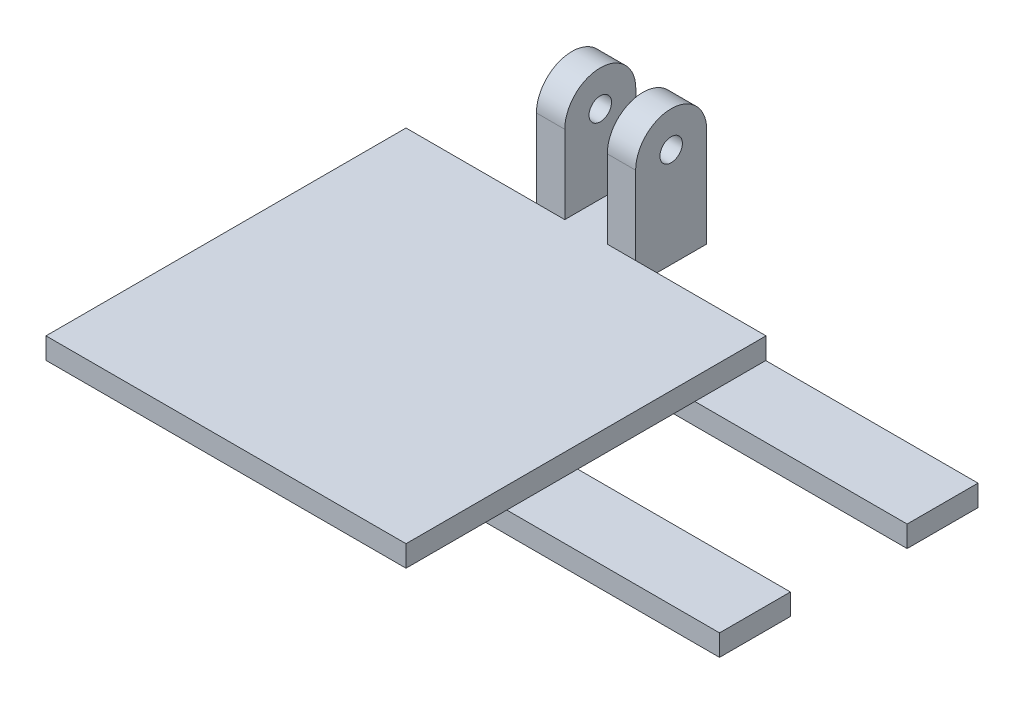
ISO-10303-21;
HEADER;
FILE_DESCRIPTION(('STEP AP214'),'2;1');
FILE_NAME('part.step','',(''),(''),'','','');
FILE_SCHEMA(('AUTOMOTIVE_DESIGN { 1 0 10303 214 1 1 1 1 }'));
ENDSEC;
DATA;
#1=APPLICATION_CONTEXT('core data for automotive mechanical design processes');
#2=APPLICATION_PROTOCOL_DEFINITION('international standard','automotive_design',2000,#1);
#3=PRODUCT_CONTEXT('',#1,'mechanical');
#4=PRODUCT('Part','Part','',(#3));
#5=PRODUCT_RELATED_PRODUCT_CATEGORY('part','',(#4));
#6=PRODUCT_DEFINITION_FORMATION('','',#4);
#7=PRODUCT_DEFINITION_CONTEXT('part definition',#1,'design');
#8=PRODUCT_DEFINITION('design','',#6,#7);
#9=PRODUCT_DEFINITION_SHAPE('','',#8);
#10=(LENGTH_UNIT() NAMED_UNIT(*) SI_UNIT(.MILLI.,.METRE.));
#11=(NAMED_UNIT(*) PLANE_ANGLE_UNIT() SI_UNIT($,.RADIAN.));
#12=(NAMED_UNIT(*) SI_UNIT($,.STERADIAN.) SOLID_ANGLE_UNIT());
#13=UNCERTAINTY_MEASURE_WITH_UNIT(LENGTH_MEASURE(1.E-05),#10,'distance_accuracy_value','');
#14=(GEOMETRIC_REPRESENTATION_CONTEXT(3) GLOBAL_UNCERTAINTY_ASSIGNED_CONTEXT((#13)) GLOBAL_UNIT_ASSIGNED_CONTEXT((#10,
#11,#12)) REPRESENTATION_CONTEXT('',''));
#15=CARTESIAN_POINT('',(0.,0.,0.));
#16=DIRECTION('',(0.,0.,1.));
#17=DIRECTION('',(1.,0.,0.));
#18=AXIS2_PLACEMENT_3D('',#15,#16,#17);
#19=CARTESIAN_POINT('',(0.,0.,0.));
#20=DIRECTION('',(0.,1.,0.));
#21=DIRECTION('',(0.,0.,1.));
#22=AXIS2_PLACEMENT_3D('',#19,#20,#21);
#23=PLANE('',#22);
#24=DIRECTION('',(-1.,0.,0.));
#25=VECTOR('',#24,1.);
#26=CARTESIAN_POINT('',(80.7529136783685,0.,-40.7574395962865));
#27=LINE('',#26,#25);
#28=CARTESIAN_POINT('',(50.8,0.,-40.7574395962864));
#29=VERTEX_POINT('',#28);
#30=CARTESIAN_POINT('',(0.,0.,-40.7574395962864));
#31=VERTEX_POINT('',#30);
#32=EDGE_CURVE('E65',#29,#31,#27,.T.);
#33=ORIENTED_EDGE('',*,*,#32,.F.);
#34=DIRECTION('',(0.,0.,-1.));
#35=VECTOR('',#34,1.);
#36=CARTESIAN_POINT('',(50.8,0.,0.));
#37=LINE('',#36,#35);
#38=CARTESIAN_POINT('',(50.8,0.,-24.2227773158367));
#39=VERTEX_POINT('',#38);
#40=EDGE_CURVE('E431',#39,#29,#37,.T.);
#41=ORIENTED_EDGE('',*,*,#40,.F.);
#42=DIRECTION('',(1.,0.,0.));
#43=VECTOR('',#42,1.);
#44=CARTESIAN_POINT('',(0.0172401323816768,0.,-24.2227773158367));
#45=LINE('',#44,#43);
#46=CARTESIAN_POINT('',(0.0172401323816768,0.,-24.2227773158367));
#47=VERTEX_POINT('',#46);
#48=EDGE_CURVE('E253',#47,#39,#45,.T.);
#49=ORIENTED_EDGE('',*,*,#48,.F.);
#50=DIRECTION('',(0.,0.,-1.));
#51=VECTOR('',#50,1.);
#52=CARTESIAN_POINT('',(0.0172401323816768,0.,-14.2227773158367));
#53=LINE('',#52,#51);
#54=CARTESIAN_POINT('',(0.0172401323816768,0.,-14.2227773158367));
#55=VERTEX_POINT('',#54);
#56=EDGE_CURVE('E249',#55,#47,#53,.T.);
#57=ORIENTED_EDGE('',*,*,#56,.F.);
#58=DIRECTION('',(-1.,0.,0.));
#59=VECTOR('',#58,1.);
#60=CARTESIAN_POINT('',(30.0172401323817,0.,-14.2227773158367));
#61=LINE('',#60,#59);
#62=CARTESIAN_POINT('',(50.8,0.,-14.2227773158367));
#63=VERTEX_POINT('',#62);
#64=EDGE_CURVE('E11',#63,#55,#61,.T.);
#65=ORIENTED_EDGE('',*,*,#64,.F.);
#66=CARTESIAN_POINT('',(50.8,0.,0.));
#67=VERTEX_POINT('',#66);
#68=EDGE_CURVE('E348',#67,#63,#37,.T.);
#69=ORIENTED_EDGE('',*,*,#68,.F.);
#70=DIRECTION('',(1.,0.,0.));
#71=VECTOR('',#70,1.);
#72=CARTESIAN_POINT('',(0.,0.,0.));
#73=LINE('',#72,#71);
#74=CARTESIAN_POINT('',(0.,0.,0.));
#75=VERTEX_POINT('',#74);
#76=EDGE_CURVE('E320',#75,#67,#73,.T.);
#77=ORIENTED_EDGE('',*,*,#76,.F.);
#78=DIRECTION('',(0.,0.,-1.));
#79=VECTOR('',#78,1.);
#80=CARTESIAN_POINT('',(0.,0.,0.));
#81=LINE('',#80,#79);
#82=EDGE_CURVE('E325',#75,#31,#81,.T.);
#83=ORIENTED_EDGE('',*,*,#82,.T.);
#84=EDGE_LOOP('',(#33,#41,#49,#57,#65,#69,#77,#83));
#85=FACE_BOUND('',#84,.T.);
#86=ADVANCED_FACE('F39',(#85),#23,.F.);
#87=DIRECTION('',(1.,0.,0.));
#88=VECTOR('',#87,1.);
#89=CARTESIAN_POINT('',(80.7529136783685,0.,-50.7574395962865));
#90=LINE('',#89,#88);
#91=CARTESIAN_POINT('',(0.,0.,-50.7574395962864));
#92=VERTEX_POINT('',#91);
#93=CARTESIAN_POINT('',(50.8,0.,-50.7574395962865));
#94=VERTEX_POINT('',#93);
#95=EDGE_CURVE('E828',#92,#94,#90,.T.);
#96=ORIENTED_EDGE('',*,*,#95,.F.);
#97=CARTESIAN_POINT('',(0.,0.,-50.8));
#98=VERTEX_POINT('',#97);
#99=EDGE_CURVE('E360',#92,#98,#81,.T.);
#100=ORIENTED_EDGE('',*,*,#99,.T.);
#101=DIRECTION('',(1.,0.,0.));
#102=VECTOR('',#101,1.);
#103=CARTESIAN_POINT('',(0.,0.,-50.8));
#104=LINE('',#103,#102);
#105=CARTESIAN_POINT('',(18.4,0.,-50.8));
#106=VERTEX_POINT('',#105);
#107=EDGE_CURVE('E355',#98,#106,#104,.T.);
#108=ORIENTED_EDGE('',*,*,#107,.T.);
#109=DIRECTION('',(0.,0.,-1.));
#110=VECTOR('',#109,1.);
#111=CARTESIAN_POINT('',(18.4,0.,0.));
#112=LINE('',#111,#110);
#113=CARTESIAN_POINT('',(18.4,0.,-60.8232031516567));
#114=VERTEX_POINT('',#113);
#115=EDGE_CURVE('E293',#106,#114,#112,.T.);
#116=ORIENTED_EDGE('',*,*,#115,.T.);
#117=DIRECTION('',(1.,0.,0.));
#118=VECTOR('',#117,1.);
#119=CARTESIAN_POINT('',(0.,0.,-60.8232031516567));
#120=LINE('',#119,#118);
#121=CARTESIAN_POINT('',(32.4,0.,-60.8232031516567));
#122=VERTEX_POINT('',#121);
#123=EDGE_CURVE('E354',#114,#122,#120,.T.);
#124=ORIENTED_EDGE('',*,*,#123,.T.);
#125=DIRECTION('',(0.,0.,-1.));
#126=VECTOR('',#125,1.);
#127=CARTESIAN_POINT('',(32.4,0.,0.));
#128=LINE('',#127,#126);
#129=CARTESIAN_POINT('',(32.4,0.,-50.8));
#130=VERTEX_POINT('',#129);
#131=EDGE_CURVE('E308',#130,#122,#128,.T.);
#132=ORIENTED_EDGE('',*,*,#131,.F.);
#133=CARTESIAN_POINT('',(50.8,0.,-50.8));
#134=VERTEX_POINT('',#133);
#135=EDGE_CURVE('E351',#130,#134,#104,.T.);
#136=ORIENTED_EDGE('',*,*,#135,.T.);
#137=EDGE_CURVE('E57',#94,#134,#37,.T.);
#138=ORIENTED_EDGE('',*,*,#137,.F.);
#139=EDGE_LOOP('',(#96,#100,#108,#116,#124,#132,#136,#138));
#140=FACE_BOUND('',#139,.T.);
#141=ADVANCED_FACE('F387',(#140),#23,.F.);
#142=CARTESIAN_POINT('',(0.,3.,-50.8));
#143=DIRECTION('',(0.,0.,-1.));
#144=DIRECTION('',(-1.,0.,0.));
#145=AXIS2_PLACEMENT_3D('',#142,#143,#144);
#146=PLANE('',#145);
#147=ORIENTED_EDGE('',*,*,#135,.F.);
#148=DIRECTION('',(0.,-1.,0.));
#149=VECTOR('',#148,1.);
#150=CARTESIAN_POINT('',(32.4,19.05,-50.8));
#151=LINE('',#150,#149);
#152=CARTESIAN_POINT('',(32.4,3.00000000000001,-50.8));
#153=VERTEX_POINT('',#152);
#154=EDGE_CURVE('E315',#153,#130,#151,.T.);
#155=ORIENTED_EDGE('',*,*,#154,.F.);
#156=DIRECTION('',(1.,0.,0.));
#157=VECTOR('',#156,1.);
#158=CARTESIAN_POINT('',(0.,3.,-50.8));
#159=LINE('',#158,#157);
#160=CARTESIAN_POINT('',(50.8,3.,-50.8));
#161=VERTEX_POINT('',#160);
#162=EDGE_CURVE('E328',#153,#161,#159,.T.);
#163=ORIENTED_EDGE('',*,*,#162,.T.);
#164=DIRECTION('',(0.,-1.,0.));
#165=VECTOR('',#164,1.);
#166=CARTESIAN_POINT('',(50.8,3.,-50.8));
#167=LINE('',#166,#165);
#168=EDGE_CURVE('E365',#161,#134,#167,.T.);
#169=ORIENTED_EDGE('',*,*,#168,.T.);
#170=EDGE_LOOP('',(#147,#155,#163,#169));
#171=FACE_BOUND('',#170,.T.);
#172=ADVANCED_FACE('F428',(#171),#146,.T.);
#173=CARTESIAN_POINT('',(0.,3.,0.));
#174=DIRECTION('',(0.,0.,-1.));
#175=DIRECTION('',(-1.,0.,0.));
#176=AXIS2_PLACEMENT_3D('',#173,#174,#175);
#177=PLANE('',#176);
#178=ORIENTED_EDGE('',*,*,#76,.T.);
#179=DIRECTION('',(0.,-1.,0.));
#180=VECTOR('',#179,1.);
#181=CARTESIAN_POINT('',(50.8,3.,0.));
#182=LINE('',#181,#180);
#183=CARTESIAN_POINT('',(50.8,3.,0.));
#184=VERTEX_POINT('',#183);
#185=EDGE_CURVE('E48',#184,#67,#182,.T.);
#186=ORIENTED_EDGE('',*,*,#185,.F.);
#187=DIRECTION('',(1.,0.,0.));
#188=VECTOR('',#187,1.);
#189=CARTESIAN_POINT('',(0.,3.,0.));
#190=LINE('',#189,#188);
#191=CARTESIAN_POINT('',(0.,3.,0.));
#192=VERTEX_POINT('',#191);
#193=EDGE_CURVE('E321',#192,#184,#190,.T.);
#194=ORIENTED_EDGE('',*,*,#193,.F.);
#195=DIRECTION('',(0.,-1.,0.));
#196=VECTOR('',#195,1.);
#197=CARTESIAN_POINT('',(0.,3.,0.));
#198=LINE('',#197,#196);
#199=EDGE_CURVE('E345',#192,#75,#198,.T.);
#200=ORIENTED_EDGE('',*,*,#199,.T.);
#201=EDGE_LOOP('',(#178,#186,#194,#200));
#202=FACE_BOUND('',#201,.T.);
#203=ADVANCED_FACE('F41',(#202),#177,.F.);
#204=CARTESIAN_POINT('',(50.8,3.,0.));
#205=DIRECTION('',(-1.,0.,0.));
#206=DIRECTION('',(0.,0.,1.));
#207=AXIS2_PLACEMENT_3D('',#204,#205,#206);
#208=PLANE('',#207);
#209=ORIENTED_EDGE('',*,*,#68,.T.);
#210=EDGE_CURVE('E352',#63,#39,#37,.T.);
#211=ORIENTED_EDGE('',*,*,#210,.T.);
#212=ORIENTED_EDGE('',*,*,#40,.T.);
#213=DIRECTION('',(0.,0.,-1.));
#214=VECTOR('',#213,1.);
#215=CARTESIAN_POINT('',(50.8,0.,0.));
#216=LINE('',#215,#214);
#217=EDGE_CURVE('E231',#29,#94,#216,.T.);
#218=ORIENTED_EDGE('',*,*,#217,.T.);
#219=ORIENTED_EDGE('',*,*,#137,.T.);
#220=ORIENTED_EDGE('',*,*,#168,.F.);
#221=DIRECTION('',(0.,0.,-1.));
#222=VECTOR('',#221,1.);
#223=CARTESIAN_POINT('',(50.8,3.,0.));
#224=LINE('',#223,#222);
#225=EDGE_CURVE('E324',#184,#161,#224,.T.);
#226=ORIENTED_EDGE('',*,*,#225,.F.);
#227=ORIENTED_EDGE('',*,*,#185,.T.);
#228=EDGE_LOOP('',(#209,#211,#212,#218,#219,#220,#226,#227));
#229=FACE_BOUND('',#228,.T.);
#230=ADVANCED_FACE('F370',(#229),#208,.F.);
#231=CARTESIAN_POINT('',(0.,3.,-60.8232031516567));
#232=DIRECTION('',(0.,0.,-1.));
#233=DIRECTION('',(-1.,0.,0.));
#234=AXIS2_PLACEMENT_3D('',#231,#232,#233);
#235=PLANE('',#234);
#236=DIRECTION('',(1.,0.,0.));
#237=VECTOR('',#236,1.);
#238=CARTESIAN_POINT('',(13.35,14.0383984241718,-60.8232031516567));
#239=LINE('',#238,#237);
#240=CARTESIAN_POINT('',(28.4,14.0383984241718,-60.8232031516567));
#241=VERTEX_POINT('',#240);
#242=CARTESIAN_POINT('',(32.4,14.0383984241718,-60.8232031516567));
#243=VERTEX_POINT('',#242);
#244=EDGE_CURVE('E272',#241,#243,#239,.T.);
#245=ORIENTED_EDGE('',*,*,#244,.T.);
#246=DIRECTION('',(0.,-1.,0.));
#247=VECTOR('',#246,1.);
#248=CARTESIAN_POINT('',(32.4,19.05,-60.8232031516567));
#249=LINE('',#248,#247);
#250=EDGE_CURVE('E313',#243,#122,#249,.T.);
#251=ORIENTED_EDGE('',*,*,#250,.T.);
#252=ORIENTED_EDGE('',*,*,#123,.F.);
#253=DIRECTION('',(0.,-1.,0.));
#254=VECTOR('',#253,1.);
#255=CARTESIAN_POINT('',(18.4,19.05,-60.8232031516567));
#256=LINE('',#255,#254);
#257=CARTESIAN_POINT('',(18.4,14.0383984241718,-60.8232031516567));
#258=VERTEX_POINT('',#257);
#259=EDGE_CURVE('E299',#258,#114,#256,.T.);
#260=ORIENTED_EDGE('',*,*,#259,.F.);
#261=CARTESIAN_POINT('',(22.4,14.0383984241718,-60.8232031516567));
#262=VERTEX_POINT('',#261);
#263=EDGE_CURVE('E275',#258,#262,#239,.T.);
#264=ORIENTED_EDGE('',*,*,#263,.T.);
#265=DIRECTION('',(0.,-1.,0.));
#266=VECTOR('',#265,1.);
#267=CARTESIAN_POINT('',(22.4,19.05,-60.8232031516567));
#268=LINE('',#267,#266);
#269=CARTESIAN_POINT('',(22.4,3.00000000000001,-60.8232031516567));
#270=VERTEX_POINT('',#269);
#271=EDGE_CURVE('E301',#262,#270,#268,.T.);
#272=ORIENTED_EDGE('',*,*,#271,.T.);
#273=DIRECTION('',(1.,0.,0.));
#274=VECTOR('',#273,1.);
#275=CARTESIAN_POINT('',(0.,3.,-60.8232031516567));
#276=LINE('',#275,#274);
#277=CARTESIAN_POINT('',(28.4,3.00000000000001,-60.8232031516567));
#278=VERTEX_POINT('',#277);
#279=EDGE_CURVE('E336',#270,#278,#276,.T.);
#280=ORIENTED_EDGE('',*,*,#279,.T.);
#281=DIRECTION('',(0.,-1.,0.));
#282=VECTOR('',#281,1.);
#283=CARTESIAN_POINT('',(28.4,19.05,-60.8232031516567));
#284=LINE('',#283,#282);
#285=EDGE_CURVE('E311',#241,#278,#284,.T.);
#286=ORIENTED_EDGE('',*,*,#285,.F.);
#287=EDGE_LOOP('',(#245,#251,#252,#260,#264,#272,#280,#286));
#288=FACE_BOUND('',#287,.T.);
#289=ADVANCED_FACE('F416',(#288),#235,.T.);
#290=DIRECTION('',(0.,-1.,0.));
#291=VECTOR('',#290,1.);
#292=CARTESIAN_POINT('',(18.4,19.05,-50.8));
#293=LINE('',#292,#291);
#294=CARTESIAN_POINT('',(18.4,3.00000000000001,-50.8));
#295=VERTEX_POINT('',#294);
#296=EDGE_CURVE('E296',#295,#106,#293,.T.);
#297=ORIENTED_EDGE('',*,*,#296,.T.);
#298=ORIENTED_EDGE('',*,*,#107,.F.);
#299=DIRECTION('',(0.,-1.,0.));
#300=VECTOR('',#299,1.);
#301=CARTESIAN_POINT('',(0.,3.,-50.8));
#302=LINE('',#301,#300);
#303=CARTESIAN_POINT('',(0.,3.,-50.8));
#304=VERTEX_POINT('',#303);
#305=EDGE_CURVE('E362',#304,#98,#302,.T.);
#306=ORIENTED_EDGE('',*,*,#305,.F.);
#307=EDGE_CURVE('E333',#304,#295,#159,.T.);
#308=ORIENTED_EDGE('',*,*,#307,.T.);
#309=EDGE_LOOP('',(#297,#298,#306,#308));
#310=FACE_BOUND('',#309,.T.);
#311=ADVANCED_FACE('F390',(#310),#146,.T.);
#312=CARTESIAN_POINT('',(0.,3.,0.));
#313=DIRECTION('',(-1.,0.,0.));
#314=DIRECTION('',(0.,0.,1.));
#315=AXIS2_PLACEMENT_3D('',#312,#313,#314);
#316=PLANE('',#315);
#317=ORIENTED_EDGE('',*,*,#82,.F.);
#318=ORIENTED_EDGE('',*,*,#199,.F.);
#319=DIRECTION('',(0.,0.,-1.));
#320=VECTOR('',#319,1.);
#321=CARTESIAN_POINT('',(0.,3.,0.));
#322=LINE('',#321,#320);
#323=EDGE_CURVE('E342',#192,#304,#322,.T.);
#324=ORIENTED_EDGE('',*,*,#323,.T.);
#325=ORIENTED_EDGE('',*,*,#305,.T.);
#326=ORIENTED_EDGE('',*,*,#99,.F.);
#327=EDGE_CURVE('E359',#31,#92,#81,.T.);
#328=ORIENTED_EDGE('',*,*,#327,.F.);
#329=EDGE_LOOP('',(#317,#318,#324,#325,#326,#328));
#330=FACE_BOUND('',#329,.T.);
#331=ADVANCED_FACE('F380',(#330),#316,.T.);
#332=CARTESIAN_POINT('',(0.,3.,0.));
#333=DIRECTION('',(0.,1.,0.));
#334=DIRECTION('',(0.,0.,1.));
#335=AXIS2_PLACEMENT_3D('',#332,#333,#334);
#336=PLANE('',#335);
#337=ORIENTED_EDGE('',*,*,#193,.T.);
#338=ORIENTED_EDGE('',*,*,#225,.T.);
#339=ORIENTED_EDGE('',*,*,#162,.F.);
#340=CARTESIAN_POINT('',(28.4,3.00000000000001,-50.8));
#341=VERTEX_POINT('',#340);
#342=EDGE_CURVE('E329',#341,#153,#159,.T.);
#343=ORIENTED_EDGE('',*,*,#342,.F.);
#344=DIRECTION('',(0.,0.,-1.));
#345=VECTOR('',#344,1.);
#346=CARTESIAN_POINT('',(28.4,3.,0.));
#347=LINE('',#346,#345);
#348=EDGE_CURVE('E332',#341,#278,#347,.T.);
#349=ORIENTED_EDGE('',*,*,#348,.T.);
#350=ORIENTED_EDGE('',*,*,#279,.F.);
#351=DIRECTION('',(0.,0.,-1.));
#352=VECTOR('',#351,1.);
#353=CARTESIAN_POINT('',(22.4,3.,0.));
#354=LINE('',#353,#352);
#355=CARTESIAN_POINT('',(22.4,3.00000000000001,-50.8));
#356=VERTEX_POINT('',#355);
#357=EDGE_CURVE('E339',#356,#270,#354,.T.);
#358=ORIENTED_EDGE('',*,*,#357,.F.);
#359=DIRECTION('',(-1.,0.,0.));
#360=VECTOR('',#359,1.);
#361=CARTESIAN_POINT('',(0.,3.,-50.8));
#362=LINE('',#361,#360);
#363=EDGE_CURVE('E305',#356,#295,#362,.T.);
#364=ORIENTED_EDGE('',*,*,#363,.T.);
#365=ORIENTED_EDGE('',*,*,#307,.F.);
#366=ORIENTED_EDGE('',*,*,#323,.F.);
#367=EDGE_LOOP('',(#337,#338,#339,#343,#349,#350,#358,#364,#365,#366));
#368=FACE_BOUND('',#367,.T.);
#369=ADVANCED_FACE('F402',(#368),#336,.T.);
#370=CARTESIAN_POINT('',(28.4,19.05,0.));
#371=DIRECTION('',(-1.,0.,0.));
#372=DIRECTION('',(0.,0.,1.));
#373=AXIS2_PLACEMENT_3D('',#370,#371,#372);
#374=PLANE('',#373);
#375=CARTESIAN_POINT('',(28.4,14.0383984241718,-55.8116015758283));
#376=DIRECTION('',(-1.,0.,0.));
#377=DIRECTION('',(0.,0.,1.));
#378=AXIS2_PLACEMENT_3D('',#375,#376,#377);
#379=CIRCLE('',#378,5.01160157582835);
#380=CARTESIAN_POINT('',(28.4,14.0383984241718,-50.8));
#381=VERTEX_POINT('',#380);
#382=EDGE_CURVE('E285',#241,#381,#379,.F.);
#383=ORIENTED_EDGE('',*,*,#382,.F.);
#384=ORIENTED_EDGE('',*,*,#285,.T.);
#385=ORIENTED_EDGE('',*,*,#348,.F.);
#386=DIRECTION('',(0.,-1.,0.));
#387=VECTOR('',#386,1.);
#388=CARTESIAN_POINT('',(28.4,19.05,-50.8));
#389=LINE('',#388,#387);
#390=EDGE_CURVE('E318',#381,#341,#389,.T.);
#391=ORIENTED_EDGE('',*,*,#390,.F.);
#392=EDGE_LOOP('',(#383,#384,#385,#391));
#393=FACE_BOUND('',#392,.T.);
#394=CARTESIAN_POINT('',(28.4,14.0383984241718,-55.8116015758283));
#395=DIRECTION('',(-1.,0.,0.));
#396=DIRECTION('',(0.,0.,1.));
#397=AXIS2_PLACEMENT_3D('',#394,#395,#396);
#398=CIRCLE('',#397,1.5875);
#399=CARTESIAN_POINT('',(28.4,14.0383984241718,-54.2241015758283));
#400=VERTEX_POINT('',#399);
#401=EDGE_CURVE('E290',#400,#400,#398,.T.);
#402=ORIENTED_EDGE('',*,*,#401,.F.);
#403=EDGE_LOOP('',(#402));
#404=FACE_BOUND('',#403,.T.);
#405=ADVANCED_FACE('F557',(#393,#404),#374,.T.);
#406=CARTESIAN_POINT('',(0.,19.05,-50.8));
#407=DIRECTION('',(0.,0.,-1.));
#408=DIRECTION('',(-1.,0.,0.));
#409=AXIS2_PLACEMENT_3D('',#406,#407,#408);
#410=PLANE('',#409);
#411=CARTESIAN_POINT('',(32.4,14.0383984241718,-50.8));
#412=VERTEX_POINT('',#411);
#413=EDGE_CURVE('E316',#412,#153,#151,.T.);
#414=ORIENTED_EDGE('',*,*,#413,.F.);
#415=DIRECTION('',(1.,0.,0.));
#416=VECTOR('',#415,1.);
#417=CARTESIAN_POINT('',(13.35,14.0383984241718,-50.8));
#418=LINE('',#417,#416);
#419=EDGE_CURVE('E271',#381,#412,#418,.T.);
#420=ORIENTED_EDGE('',*,*,#419,.F.);
#421=ORIENTED_EDGE('',*,*,#390,.T.);
#422=ORIENTED_EDGE('',*,*,#342,.T.);
#423=EDGE_LOOP('',(#414,#420,#421,#422));
#424=FACE_BOUND('',#423,.T.);
#425=ADVANCED_FACE('F565',(#424),#410,.F.);
#426=CARTESIAN_POINT('',(32.4,19.05,0.));
#427=DIRECTION('',(-1.,0.,0.));
#428=DIRECTION('',(0.,0.,1.));
#429=AXIS2_PLACEMENT_3D('',#426,#427,#428);
#430=PLANE('',#429);
#431=CARTESIAN_POINT('',(32.4,14.0383984241718,-55.8116015758283));
#432=DIRECTION('',(1.,0.,0.));
#433=DIRECTION('',(0.,0.,-1.));
#434=AXIS2_PLACEMENT_3D('',#431,#432,#433);
#435=CIRCLE('',#434,1.5875);
#436=CARTESIAN_POINT('',(32.4,14.0383984241718,-57.3991015758283));
#437=VERTEX_POINT('',#436);
#438=EDGE_CURVE('E278',#437,#437,#435,.T.);
#439=ORIENTED_EDGE('',*,*,#438,.F.);
#440=EDGE_LOOP('',(#439));
#441=FACE_BOUND('',#440,.T.);
#442=ORIENTED_EDGE('',*,*,#250,.F.);
#443=CARTESIAN_POINT('',(32.4,14.0383984241718,-55.8116015758283));
#444=DIRECTION('',(-1.,0.,0.));
#445=DIRECTION('',(0.,0.,1.));
#446=AXIS2_PLACEMENT_3D('',#443,#444,#445);
#447=CIRCLE('',#446,5.01160157582835);
#448=EDGE_CURVE('E269',#412,#243,#447,.T.);
#449=ORIENTED_EDGE('',*,*,#448,.F.);
#450=ORIENTED_EDGE('',*,*,#413,.T.);
#451=ORIENTED_EDGE('',*,*,#154,.T.);
#452=ORIENTED_EDGE('',*,*,#131,.T.);
#453=EDGE_LOOP('',(#442,#449,#450,#451,#452));
#454=FACE_BOUND('',#453,.T.);
#455=ADVANCED_FACE('F421',(#441,#454),#430,.F.);
#456=CARTESIAN_POINT('',(0.,19.05,-50.8));
#457=DIRECTION('',(0.,0.,-1.));
#458=DIRECTION('',(-1.,0.,0.));
#459=AXIS2_PLACEMENT_3D('',#456,#457,#458);
#460=PLANE('',#459);
#461=DIRECTION('',(0.,-1.,0.));
#462=VECTOR('',#461,1.);
#463=CARTESIAN_POINT('',(22.4,19.05,-50.8));
#464=LINE('',#463,#462);
#465=CARTESIAN_POINT('',(22.4,14.0383984241718,-50.8));
#466=VERTEX_POINT('',#465);
#467=EDGE_CURVE('E303',#466,#356,#464,.T.);
#468=ORIENTED_EDGE('',*,*,#467,.F.);
#469=CARTESIAN_POINT('',(18.4,14.0383984241718,-50.8));
#470=VERTEX_POINT('',#469);
#471=EDGE_CURVE('E276',#470,#466,#418,.T.);
#472=ORIENTED_EDGE('',*,*,#471,.F.);
#473=EDGE_CURVE('E297',#470,#295,#293,.T.);
#474=ORIENTED_EDGE('',*,*,#473,.T.);
#475=ORIENTED_EDGE('',*,*,#363,.F.);
#476=EDGE_LOOP('',(#468,#472,#474,#475));
#477=FACE_BOUND('',#476,.T.);
#478=ADVANCED_FACE('F407',(#477),#460,.F.);
#479=CARTESIAN_POINT('',(22.4,19.05,0.));
#480=DIRECTION('',(-1.,0.,0.));
#481=DIRECTION('',(0.,0.,1.));
#482=AXIS2_PLACEMENT_3D('',#479,#480,#481);
#483=PLANE('',#482);
#484=CARTESIAN_POINT('',(22.4,14.0383984241718,-55.8116015758283));
#485=DIRECTION('',(-1.,0.,0.));
#486=DIRECTION('',(0.,0.,1.));
#487=AXIS2_PLACEMENT_3D('',#484,#485,#486);
#488=CIRCLE('',#487,1.5875);
#489=CARTESIAN_POINT('',(22.4,14.0383984241718,-54.2241015758283));
#490=VERTEX_POINT('',#489);
#491=EDGE_CURVE('E287',#490,#490,#488,.T.);
#492=ORIENTED_EDGE('',*,*,#491,.T.);
#493=EDGE_LOOP('',(#492));
#494=FACE_BOUND('',#493,.T.);
#495=ORIENTED_EDGE('',*,*,#271,.F.);
#496=CARTESIAN_POINT('',(22.4,14.0383984241718,-55.8116015758283));
#497=DIRECTION('',(-1.,0.,0.));
#498=DIRECTION('',(0.,0.,1.));
#499=AXIS2_PLACEMENT_3D('',#496,#497,#498);
#500=CIRCLE('',#499,5.01160157582835);
#501=EDGE_CURVE('E283',#262,#466,#500,.F.);
#502=ORIENTED_EDGE('',*,*,#501,.T.);
#503=ORIENTED_EDGE('',*,*,#467,.T.);
#504=ORIENTED_EDGE('',*,*,#357,.T.);
#505=EDGE_LOOP('',(#495,#502,#503,#504));
#506=FACE_BOUND('',#505,.T.);
#507=ADVANCED_FACE('F585',(#494,#506),#483,.F.);
#508=CARTESIAN_POINT('',(18.4,19.05,0.));
#509=DIRECTION('',(-1.,0.,0.));
#510=DIRECTION('',(0.,0.,1.));
#511=AXIS2_PLACEMENT_3D('',#508,#509,#510);
#512=PLANE('',#511);
#513=CARTESIAN_POINT('',(18.4,14.0383984241718,-55.8116015758283));
#514=DIRECTION('',(-1.,0.,0.));
#515=DIRECTION('',(0.,0.,1.));
#516=AXIS2_PLACEMENT_3D('',#513,#514,#515);
#517=CIRCLE('',#516,5.01160157582835);
#518=EDGE_CURVE('E281',#258,#470,#517,.F.);
#519=ORIENTED_EDGE('',*,*,#518,.F.);
#520=ORIENTED_EDGE('',*,*,#259,.T.);
#521=ORIENTED_EDGE('',*,*,#115,.F.);
#522=ORIENTED_EDGE('',*,*,#296,.F.);
#523=ORIENTED_EDGE('',*,*,#473,.F.);
#524=EDGE_LOOP('',(#519,#520,#521,#522,#523));
#525=FACE_BOUND('',#524,.T.);
#526=CARTESIAN_POINT('',(18.4,14.0383984241718,-55.8116015758283));
#527=DIRECTION('',(-1.,0.,0.));
#528=DIRECTION('',(0.,0.,1.));
#529=AXIS2_PLACEMENT_3D('',#526,#527,#528);
#530=CIRCLE('',#529,1.5875);
#531=CARTESIAN_POINT('',(18.4,14.0383984241718,-54.2241015758283));
#532=VERTEX_POINT('',#531);
#533=EDGE_CURVE('E43',#532,#532,#530,.T.);
#534=ORIENTED_EDGE('',*,*,#533,.F.);
#535=EDGE_LOOP('',(#534));
#536=FACE_BOUND('',#535,.T.);
#537=ADVANCED_FACE('F397',(#525,#536),#512,.T.);
#538=CARTESIAN_POINT('',(13.35,14.0383984241718,-55.8116015758283));
#539=DIRECTION('',(1.,0.,0.));
#540=DIRECTION('',(0.,0.,-1.));
#541=AXIS2_PLACEMENT_3D('',#538,#539,#540);
#542=CYLINDRICAL_SURFACE('',#541,1.5875);
#543=ORIENTED_EDGE('',*,*,#533,.T.);
#544=EDGE_LOOP('',(#543));
#545=FACE_BOUND('',#544,.T.);
#546=ORIENTED_EDGE('',*,*,#491,.F.);
#547=EDGE_LOOP('',(#546));
#548=FACE_BOUND('',#547,.T.);
#549=ADVANCED_FACE('F599',(#545,#548),#542,.F.);
#550=CARTESIAN_POINT('',(13.35,14.0383984241718,-55.8116015758283));
#551=DIRECTION('',(1.,0.,0.));
#552=DIRECTION('',(0.,0.,-1.));
#553=AXIS2_PLACEMENT_3D('',#550,#551,#552);
#554=CYLINDRICAL_SURFACE('',#553,5.01160157582835);
#555=ORIENTED_EDGE('',*,*,#263,.F.);
#556=ORIENTED_EDGE('',*,*,#518,.T.);
#557=ORIENTED_EDGE('',*,*,#471,.T.);
#558=ORIENTED_EDGE('',*,*,#501,.F.);
#559=EDGE_LOOP('',(#555,#556,#557,#558));
#560=FACE_BOUND('',#559,.T.);
#561=ADVANCED_FACE('F411',(#560),#554,.T.);
#562=ORIENTED_EDGE('',*,*,#401,.T.);
#563=EDGE_LOOP('',(#562));
#564=FACE_BOUND('',#563,.T.);
#565=ORIENTED_EDGE('',*,*,#438,.T.);
#566=EDGE_LOOP('',(#565));
#567=FACE_BOUND('',#566,.T.);
#568=ADVANCED_FACE('F606',(#564,#567),#542,.F.);
#569=ORIENTED_EDGE('',*,*,#382,.T.);
#570=ORIENTED_EDGE('',*,*,#419,.T.);
#571=ORIENTED_EDGE('',*,*,#448,.T.);
#572=ORIENTED_EDGE('',*,*,#244,.F.);
#573=EDGE_LOOP('',(#569,#570,#571,#572));
#574=FACE_BOUND('',#573,.T.);
#575=ADVANCED_FACE('F613',(#574),#554,.T.);
#576=CARTESIAN_POINT('',(30.0172401323817,-3.,-14.2227773158367));
#577=DIRECTION('',(0.,0.,-1.));
#578=DIRECTION('',(-1.,0.,0.));
#579=AXIS2_PLACEMENT_3D('',#576,#577,#578);
#580=PLANE('',#579);
#581=CARTESIAN_POINT('',(80.8172401323817,0.,-14.2227773158367));
#582=VERTEX_POINT('',#581);
#583=EDGE_CURVE('E50',#582,#63,#61,.T.);
#584=ORIENTED_EDGE('',*,*,#583,.T.);
#585=ORIENTED_EDGE('',*,*,#64,.T.);
#586=DIRECTION('',(0.,1.,0.));
#587=VECTOR('',#586,1.);
#588=CARTESIAN_POINT('',(0.0172401323816768,-3.,-14.2227773158367));
#589=LINE('',#588,#587);
#590=CARTESIAN_POINT('',(0.0172401323816768,-3.,-14.2227773158367));
#591=VERTEX_POINT('',#590);
#592=EDGE_CURVE('E266',#591,#55,#589,.T.);
#593=ORIENTED_EDGE('',*,*,#592,.F.);
#594=DIRECTION('',(-1.,0.,0.));
#595=VECTOR('',#594,1.);
#596=CARTESIAN_POINT('',(80.8172401323817,-3.,-14.2227773158367));
#597=LINE('',#596,#595);
#598=CARTESIAN_POINT('',(80.8172401323817,-3.,-14.2227773158367));
#599=VERTEX_POINT('',#598);
#600=EDGE_CURVE('E238',#599,#591,#597,.T.);
#601=ORIENTED_EDGE('',*,*,#600,.F.);
#602=DIRECTION('',(0.,1.,0.));
#603=VECTOR('',#602,1.);
#604=CARTESIAN_POINT('',(80.8172401323817,-3.,-14.2227773158367));
#605=LINE('',#604,#603);
#606=EDGE_CURVE('E246',#599,#582,#605,.T.);
#607=ORIENTED_EDGE('',*,*,#606,.T.);
#608=EDGE_LOOP('',(#584,#585,#593,#601,#607));
#609=FACE_BOUND('',#608,.T.);
#610=ADVANCED_FACE('F447',(#609),#580,.F.);
#611=CARTESIAN_POINT('',(0.0172401323816768,-3.,-14.2227773158367));
#612=DIRECTION('',(1.,0.,0.));
#613=DIRECTION('',(0.,0.,-1.));
#614=AXIS2_PLACEMENT_3D('',#611,#612,#613);
#615=PLANE('',#614);
#616=ORIENTED_EDGE('',*,*,#56,.T.);
#617=DIRECTION('',(0.,1.,0.));
#618=VECTOR('',#617,1.);
#619=CARTESIAN_POINT('',(0.0172401323816768,-3.,-24.2227773158367));
#620=LINE('',#619,#618);
#621=CARTESIAN_POINT('',(0.0172401323816768,-3.,-24.2227773158367));
#622=VERTEX_POINT('',#621);
#623=EDGE_CURVE('E263',#622,#47,#620,.T.);
#624=ORIENTED_EDGE('',*,*,#623,.F.);
#625=DIRECTION('',(0.,0.,-1.));
#626=VECTOR('',#625,1.);
#627=CARTESIAN_POINT('',(0.0172401323816768,-3.,-14.2227773158367));
#628=LINE('',#627,#626);
#629=EDGE_CURVE('E240',#591,#622,#628,.T.);
#630=ORIENTED_EDGE('',*,*,#629,.F.);
#631=ORIENTED_EDGE('',*,*,#592,.T.);
#632=EDGE_LOOP('',(#616,#624,#630,#631));
#633=FACE_BOUND('',#632,.T.);
#634=ADVANCED_FACE('F442',(#633),#615,.F.);
#635=CARTESIAN_POINT('',(0.0172401323816768,-3.,-24.2227773158367));
#636=DIRECTION('',(0.,0.,1.));
#637=DIRECTION('',(1.,0.,0.));
#638=AXIS2_PLACEMENT_3D('',#635,#636,#637);
#639=PLANE('',#638);
#640=ORIENTED_EDGE('',*,*,#48,.T.);
#641=CARTESIAN_POINT('',(80.8172401323817,0.,-24.2227773158367));
#642=VERTEX_POINT('',#641);
#643=EDGE_CURVE('E252',#39,#642,#45,.T.);
#644=ORIENTED_EDGE('',*,*,#643,.T.);
#645=DIRECTION('',(0.,1.,0.));
#646=VECTOR('',#645,1.);
#647=CARTESIAN_POINT('',(80.8172401323817,-3.,-24.2227773158367));
#648=LINE('',#647,#646);
#649=CARTESIAN_POINT('',(80.8172401323817,-3.,-24.2227773158367));
#650=VERTEX_POINT('',#649);
#651=EDGE_CURVE('E260',#650,#642,#648,.T.);
#652=ORIENTED_EDGE('',*,*,#651,.F.);
#653=DIRECTION('',(1.,0.,0.));
#654=VECTOR('',#653,1.);
#655=CARTESIAN_POINT('',(0.0172401323816768,-3.,-24.2227773158367));
#656=LINE('',#655,#654);
#657=EDGE_CURVE('E243',#622,#650,#656,.T.);
#658=ORIENTED_EDGE('',*,*,#657,.F.);
#659=ORIENTED_EDGE('',*,*,#623,.T.);
#660=EDGE_LOOP('',(#640,#644,#652,#658,#659));
#661=FACE_BOUND('',#660,.T.);
#662=ADVANCED_FACE('F438',(#661),#639,.F.);
#663=CARTESIAN_POINT('',(80.8172401323817,-3.,-24.2227773158367));
#664=DIRECTION('',(-1.,0.,0.));
#665=DIRECTION('',(0.,0.,1.));
#666=AXIS2_PLACEMENT_3D('',#663,#664,#665);
#667=PLANE('',#666);
#668=DIRECTION('',(0.,0.,1.));
#669=VECTOR('',#668,1.);
#670=CARTESIAN_POINT('',(80.8172401323817,0.,-24.2227773158367));
#671=LINE('',#670,#669);
#672=EDGE_CURVE('E241',#642,#582,#671,.T.);
#673=ORIENTED_EDGE('',*,*,#672,.T.);
#674=ORIENTED_EDGE('',*,*,#606,.F.);
#675=DIRECTION('',(0.,0.,1.));
#676=VECTOR('',#675,1.);
#677=CARTESIAN_POINT('',(80.8172401323817,-3.,-24.2227773158367));
#678=LINE('',#677,#676);
#679=EDGE_CURVE('E245',#650,#599,#678,.T.);
#680=ORIENTED_EDGE('',*,*,#679,.F.);
#681=ORIENTED_EDGE('',*,*,#651,.T.);
#682=EDGE_LOOP('',(#673,#674,#680,#681));
#683=FACE_BOUND('',#682,.T.);
#684=ADVANCED_FACE('F450',(#683),#667,.F.);
#685=CARTESIAN_POINT('',(0.,-3.,0.));
#686=DIRECTION('',(0.,-1.,0.));
#687=DIRECTION('',(0.,0.,-1.));
#688=AXIS2_PLACEMENT_3D('',#685,#686,#687);
#689=PLANE('',#688);
#690=ORIENTED_EDGE('',*,*,#600,.T.);
#691=ORIENTED_EDGE('',*,*,#629,.T.);
#692=ORIENTED_EDGE('',*,*,#657,.T.);
#693=ORIENTED_EDGE('',*,*,#679,.T.);
#694=EDGE_LOOP('',(#690,#691,#692,#693));
#695=FACE_BOUND('',#694,.T.);
#696=ADVANCED_FACE('F453',(#695),#689,.T.);
#697=CARTESIAN_POINT('',(0.,0.,0.));
#698=DIRECTION('',(0.,-1.,0.));
#699=DIRECTION('',(0.,0.,-1.));
#700=AXIS2_PLACEMENT_3D('',#697,#698,#699);
#701=PLANE('',#700);
#702=ORIENTED_EDGE('',*,*,#210,.F.);
#703=ORIENTED_EDGE('',*,*,#583,.F.);
#704=ORIENTED_EDGE('',*,*,#672,.F.);
#705=ORIENTED_EDGE('',*,*,#643,.F.);
#706=EDGE_LOOP('',(#702,#703,#704,#705));
#707=FACE_BOUND('',#706,.T.);
#708=ADVANCED_FACE('F435',(#707),#701,.F.);
#709=CARTESIAN_POINT('',(0.,0.,0.));
#710=DIRECTION('',(0.,1.,0.));
#711=DIRECTION('',(0.,0.,1.));
#712=AXIS2_PLACEMENT_3D('',#709,#710,#711);
#713=PLANE('',#712);
#714=ORIENTED_EDGE('',*,*,#217,.F.);
#715=CARTESIAN_POINT('',(80.7529136783685,0.,-40.7574395962865));
#716=VERTEX_POINT('',#715);
#717=EDGE_CURVE('E824',#716,#29,#27,.T.);
#718=ORIENTED_EDGE('',*,*,#717,.F.);
#719=DIRECTION('',(0.,0.,1.));
#720=VECTOR('',#719,1.);
#721=CARTESIAN_POINT('',(80.7529136783685,0.,-40.7574395962865));
#722=LINE('',#721,#720);
#723=CARTESIAN_POINT('',(80.7529136783685,0.,-50.7574395962865));
#724=VERTEX_POINT('',#723);
#725=EDGE_CURVE('E230',#724,#716,#722,.T.);
#726=ORIENTED_EDGE('',*,*,#725,.F.);
#727=EDGE_CURVE('E823',#94,#724,#90,.T.);
#728=ORIENTED_EDGE('',*,*,#727,.F.);
#729=EDGE_LOOP('',(#714,#718,#726,#728));
#730=FACE_BOUND('',#729,.T.);
#731=ADVANCED_FACE('F460',(#730),#713,.T.);
#732=CARTESIAN_POINT('',(80.7529136783685,-3.,-40.7574395962865));
#733=DIRECTION('',(-1.,0.,0.));
#734=DIRECTION('',(0.,0.,1.));
#735=AXIS2_PLACEMENT_3D('',#732,#733,#734);
#736=PLANE('',#735);
#737=ORIENTED_EDGE('',*,*,#725,.T.);
#738=DIRECTION('',(0.,1.,0.));
#739=VECTOR('',#738,1.);
#740=CARTESIAN_POINT('',(80.7529136783685,-3.,-40.7574395962865));
#741=LINE('',#740,#739);
#742=CARTESIAN_POINT('',(80.7529136783685,-3.,-40.7574395962865));
#743=VERTEX_POINT('',#742);
#744=EDGE_CURVE('E210',#743,#716,#741,.T.);
#745=ORIENTED_EDGE('',*,*,#744,.F.);
#746=DIRECTION('',(0.,0.,1.));
#747=VECTOR('',#746,1.);
#748=CARTESIAN_POINT('',(80.7529136783685,-3.,-40.7574395962865));
#749=LINE('',#748,#747);
#750=CARTESIAN_POINT('',(80.7529136783685,-3.,-50.7574395962865));
#751=VERTEX_POINT('',#750);
#752=EDGE_CURVE('E217',#751,#743,#749,.T.);
#753=ORIENTED_EDGE('',*,*,#752,.F.);
#754=DIRECTION('',(0.,1.,0.));
#755=VECTOR('',#754,1.);
#756=CARTESIAN_POINT('',(80.7529136783685,-3.,-50.7574395962865));
#757=LINE('',#756,#755);
#758=EDGE_CURVE('E827',#751,#724,#757,.T.);
#759=ORIENTED_EDGE('',*,*,#758,.T.);
#760=EDGE_LOOP('',(#737,#745,#753,#759));
#761=FACE_BOUND('',#760,.T.);
#762=ADVANCED_FACE('F228',(#761),#736,.F.);
#763=CARTESIAN_POINT('',(80.7529136783685,-3.,-40.7574395962865));
#764=DIRECTION('',(0.,0.,-1.));
#765=DIRECTION('',(-1.,0.,0.));
#766=AXIS2_PLACEMENT_3D('',#763,#764,#765);
#767=PLANE('',#766);
#768=ORIENTED_EDGE('',*,*,#717,.T.);
#769=ORIENTED_EDGE('',*,*,#32,.T.);
#770=CARTESIAN_POINT('',(-0.0434659110697157,0.,-40.7574395962864));
#771=VERTEX_POINT('',#770);
#772=EDGE_CURVE('E831',#31,#771,#27,.T.);
#773=ORIENTED_EDGE('',*,*,#772,.T.);
#774=DIRECTION('',(0.,1.,0.));
#775=VECTOR('',#774,1.);
#776=CARTESIAN_POINT('',(-0.0434659110697157,-3.,-40.7574395962864));
#777=LINE('',#776,#775);
#778=CARTESIAN_POINT('',(-0.0434659110697157,-3.,-40.7574395962864));
#779=VERTEX_POINT('',#778);
#780=EDGE_CURVE('E213',#779,#771,#777,.T.);
#781=ORIENTED_EDGE('',*,*,#780,.F.);
#782=DIRECTION('',(-1.,0.,0.));
#783=VECTOR('',#782,1.);
#784=CARTESIAN_POINT('',(80.7529136783685,-3.,-40.7574395962865));
#785=LINE('',#784,#783);
#786=EDGE_CURVE('E205',#743,#779,#785,.T.);
#787=ORIENTED_EDGE('',*,*,#786,.F.);
#788=ORIENTED_EDGE('',*,*,#744,.T.);
#789=EDGE_LOOP('',(#768,#769,#773,#781,#787,#788));
#790=FACE_BOUND('',#789,.T.);
#791=ADVANCED_FACE('F208',(#790),#767,.F.);
#792=CARTESIAN_POINT('',(-0.0434659110697157,-3.,-40.7574395962864));
#793=DIRECTION('',(1.,0.,0.));
#794=DIRECTION('',(0.,0.,-1.));
#795=AXIS2_PLACEMENT_3D('',#792,#793,#794);
#796=PLANE('',#795);
#797=DIRECTION('',(0.,0.,-1.));
#798=VECTOR('',#797,1.);
#799=CARTESIAN_POINT('',(-0.0434659110697157,0.,-40.7574395962864));
#800=LINE('',#799,#798);
#801=CARTESIAN_POINT('',(-0.0434659110697122,0.,-50.7574395962864));
#802=VERTEX_POINT('',#801);
#803=EDGE_CURVE('E821',#771,#802,#800,.T.);
#804=ORIENTED_EDGE('',*,*,#803,.T.);
#805=DIRECTION('',(0.,1.,0.));
#806=VECTOR('',#805,1.);
#807=CARTESIAN_POINT('',(-0.0434659110697122,-3.,-50.7574395962864));
#808=LINE('',#807,#806);
#809=CARTESIAN_POINT('',(-0.0434659110697122,-3.,-50.7574395962864));
#810=VERTEX_POINT('',#809);
#811=EDGE_CURVE('E234',#810,#802,#808,.T.);
#812=ORIENTED_EDGE('',*,*,#811,.F.);
#813=DIRECTION('',(0.,0.,-1.));
#814=VECTOR('',#813,1.);
#815=CARTESIAN_POINT('',(-0.0434659110697157,-3.,-40.7574395962864));
#816=LINE('',#815,#814);
#817=EDGE_CURVE('E216',#779,#810,#816,.T.);
#818=ORIENTED_EDGE('',*,*,#817,.F.);
#819=ORIENTED_EDGE('',*,*,#780,.T.);
#820=EDGE_LOOP('',(#804,#812,#818,#819));
#821=FACE_BOUND('',#820,.T.);
#822=ADVANCED_FACE('F505',(#821),#796,.F.);
#823=CARTESIAN_POINT('',(80.7529136783685,-3.,-50.7574395962865));
#824=DIRECTION('',(0.,0.,1.));
#825=DIRECTION('',(1.,0.,0.));
#826=AXIS2_PLACEMENT_3D('',#823,#824,#825);
#827=PLANE('',#826);
#828=EDGE_CURVE('E226',#802,#92,#90,.T.);
#829=ORIENTED_EDGE('',*,*,#828,.T.);
#830=ORIENTED_EDGE('',*,*,#95,.T.);
#831=ORIENTED_EDGE('',*,*,#727,.T.);
#832=ORIENTED_EDGE('',*,*,#758,.F.);
#833=DIRECTION('',(1.,0.,0.));
#834=VECTOR('',#833,1.);
#835=CARTESIAN_POINT('',(80.7529136783685,-3.,-50.7574395962865));
#836=LINE('',#835,#834);
#837=EDGE_CURVE('E222',#810,#751,#836,.T.);
#838=ORIENTED_EDGE('',*,*,#837,.F.);
#839=ORIENTED_EDGE('',*,*,#811,.T.);
#840=EDGE_LOOP('',(#829,#830,#831,#832,#838,#839));
#841=FACE_BOUND('',#840,.T.);
#842=ADVANCED_FACE('F501',(#841),#827,.F.);
#843=CARTESIAN_POINT('',(0.,-3.,0.));
#844=DIRECTION('',(0.,1.,0.));
#845=DIRECTION('',(0.,0.,1.));
#846=AXIS2_PLACEMENT_3D('',#843,#844,#845);
#847=PLANE('',#846);
#848=ORIENTED_EDGE('',*,*,#752,.T.);
#849=ORIENTED_EDGE('',*,*,#786,.T.);
#850=ORIENTED_EDGE('',*,*,#817,.T.);
#851=ORIENTED_EDGE('',*,*,#837,.T.);
#852=EDGE_LOOP('',(#848,#849,#850,#851));
#853=FACE_BOUND('',#852,.T.);
#854=ADVANCED_FACE('F220',(#853),#847,.F.);
#855=ORIENTED_EDGE('',*,*,#772,.F.);
#856=ORIENTED_EDGE('',*,*,#327,.T.);
#857=ORIENTED_EDGE('',*,*,#828,.F.);
#858=ORIENTED_EDGE('',*,*,#803,.F.);
#859=EDGE_LOOP('',(#855,#856,#857,#858));
#860=FACE_BOUND('',#859,.T.);
#861=ADVANCED_FACE('F520',(#860),#713,.T.);
#862=CLOSED_SHELL('',(#86,#141,#172,#203,#230,#289,#311,#331,#369,#405,#425,#455,#478,#507,#537,
#549,#561,#568,#575,#610,#634,#662,#684,#696,#708,#731,#762,#791,#822,#842,#854,#861));
#863=MANIFOLD_SOLID_BREP('B2',#862);
#864=ADVANCED_BREP_SHAPE_REPRESENTATION('',(#18,#863),#14);
#865=SHAPE_DEFINITION_REPRESENTATION(#9,#864);
ENDSEC;
END-ISO-10303-21;
